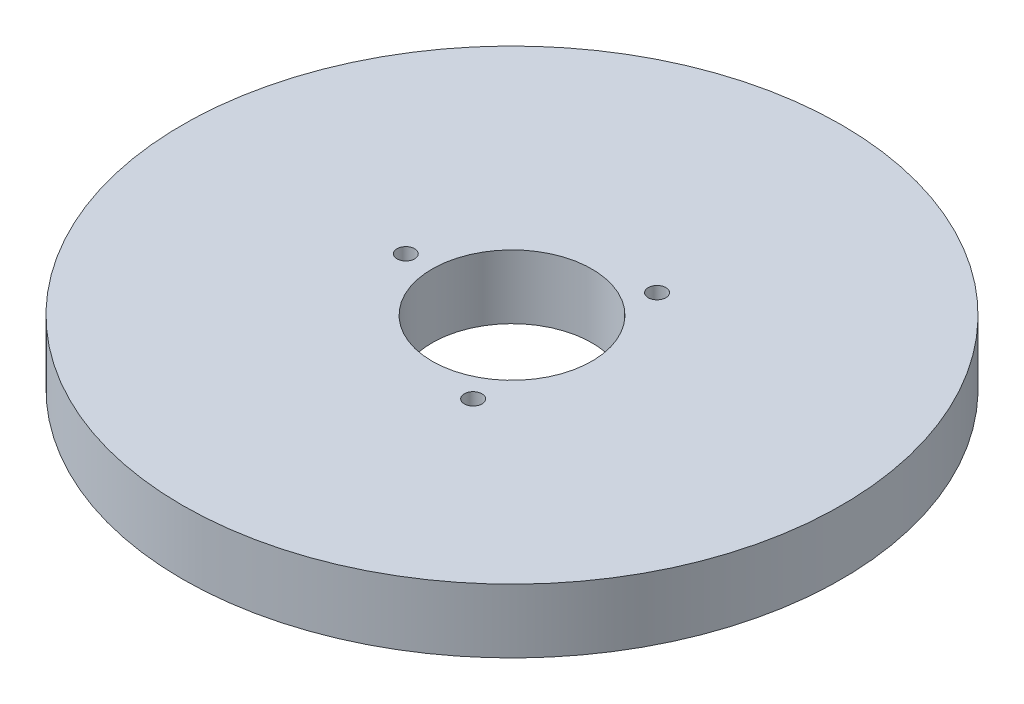
ISO-10303-21;
HEADER;
FILE_DESCRIPTION(('STEP AP214'),'2;1');
FILE_NAME('part.step','',(''),(''),'','','');
FILE_SCHEMA(('AUTOMOTIVE_DESIGN { 1 0 10303 214 1 1 1 1 }'));
ENDSEC;
DATA;
#1=APPLICATION_CONTEXT('core data for automotive mechanical design processes');
#2=APPLICATION_PROTOCOL_DEFINITION('international standard','automotive_design',2000,#1);
#3=PRODUCT_CONTEXT('',#1,'mechanical');
#4=PRODUCT('Part','Part','',(#3));
#5=PRODUCT_RELATED_PRODUCT_CATEGORY('part','',(#4));
#6=PRODUCT_DEFINITION_FORMATION('','',#4);
#7=PRODUCT_DEFINITION_CONTEXT('part definition',#1,'design');
#8=PRODUCT_DEFINITION('design','',#6,#7);
#9=PRODUCT_DEFINITION_SHAPE('','',#8);
#10=(LENGTH_UNIT() NAMED_UNIT(*) SI_UNIT(.MILLI.,.METRE.));
#11=(NAMED_UNIT(*) PLANE_ANGLE_UNIT() SI_UNIT($,.RADIAN.));
#12=(NAMED_UNIT(*) SI_UNIT($,.STERADIAN.) SOLID_ANGLE_UNIT());
#13=UNCERTAINTY_MEASURE_WITH_UNIT(LENGTH_MEASURE(1.E-05),#10,'distance_accuracy_value','');
#14=(GEOMETRIC_REPRESENTATION_CONTEXT(3) GLOBAL_UNCERTAINTY_ASSIGNED_CONTEXT((#13)) GLOBAL_UNIT_ASSIGNED_CONTEXT((#10,
#11,#12)) REPRESENTATION_CONTEXT('',''));
#15=CARTESIAN_POINT('',(0.,0.,0.));
#16=DIRECTION('',(0.,0.,1.));
#17=DIRECTION('',(1.,0.,0.));
#18=AXIS2_PLACEMENT_3D('',#15,#16,#17);
#19=CARTESIAN_POINT('',(0.,16.,0.));
#20=DIRECTION('',(0.,-1.,0.));
#21=DIRECTION('',(0.,0.,-1.));
#22=AXIS2_PLACEMENT_3D('',#19,#20,#21);
#23=CYLINDRICAL_SURFACE('',#22,82.5);
#24=CARTESIAN_POINT('',(0.,16.,0.));
#25=DIRECTION('',(0.,1.,0.));
#26=DIRECTION('',(0.,0.,1.));
#27=AXIS2_PLACEMENT_3D('',#24,#25,#26);
#28=CIRCLE('',#27,82.5);
#29=CARTESIAN_POINT('',(0.,16.,82.5));
#30=VERTEX_POINT('',#29);
#31=EDGE_CURVE('E10',#30,#30,#28,.T.);
#32=ORIENTED_EDGE('',*,*,#31,.F.);
#33=EDGE_LOOP('',(#32));
#34=FACE_BOUND('',#33,.T.);
#35=CARTESIAN_POINT('',(0.,0.,0.));
#36=DIRECTION('',(0.,1.,0.));
#37=DIRECTION('',(0.,0.,1.));
#38=AXIS2_PLACEMENT_3D('',#35,#36,#37);
#39=CIRCLE('',#38,82.5);
#40=CARTESIAN_POINT('',(0.,0.,82.5));
#41=VERTEX_POINT('',#40);
#42=EDGE_CURVE('E37',#41,#41,#39,.T.);
#43=ORIENTED_EDGE('',*,*,#42,.T.);
#44=EDGE_LOOP('',(#43));
#45=FACE_BOUND('',#44,.T.);
#46=ADVANCED_FACE('F40',(#34,#45),#23,.T.);
#47=CARTESIAN_POINT('',(0.,16.,0.));
#48=DIRECTION('',(0.,1.,0.));
#49=DIRECTION('',(0.,0.,1.));
#50=AXIS2_PLACEMENT_3D('',#47,#48,#49);
#51=PLANE('',#50);
#52=CARTESIAN_POINT('',(13.2921370757235,16.,23.0226567563229));
#53=DIRECTION('',(0.,1.,0.));
#54=DIRECTION('',(0.866025403784436,0.,-0.500000000000004));
#55=AXIS2_PLACEMENT_3D('',#52,#53,#54);
#56=CIRCLE('',#55,2.2087436824083);
#57=CARTESIAN_POINT('',(15.2049652151375,16.,21.9182849151188));
#58=VERTEX_POINT('',#57);
#59=EDGE_CURVE('E70',#58,#58,#56,.T.);
#60=ORIENTED_EDGE('',*,*,#59,.F.);
#61=EDGE_LOOP('',(#60));
#62=FACE_BOUND('',#61,.T.);
#63=CARTESIAN_POINT('',(13.2921370757232,16.,-23.0226567563231));
#64=DIRECTION('',(0.,1.,0.));
#65=DIRECTION('',(-0.866025403784443,0.,-0.499999999999992));
#66=AXIS2_PLACEMENT_3D('',#63,#64,#65);
#67=CIRCLE('',#66,2.2087436824083);
#68=CARTESIAN_POINT('',(11.3793089363092,16.,-24.1270285975272));
#69=VERTEX_POINT('',#68);
#70=EDGE_CURVE('E61',#69,#69,#67,.T.);
#71=ORIENTED_EDGE('',*,*,#70,.F.);
#72=EDGE_LOOP('',(#71));
#73=FACE_BOUND('',#72,.T.);
#74=CARTESIAN_POINT('',(-26.5842741514469,16.,0.));
#75=DIRECTION('',(0.,1.,0.));
#76=DIRECTION('',(0.,0.,1.));
#77=AXIS2_PLACEMENT_3D('',#74,#75,#76);
#78=CIRCLE('',#77,2.2087436824083);
#79=CARTESIAN_POINT('',(-26.5842741514469,16.,2.2087436824083));
#80=VERTEX_POINT('',#79);
#81=EDGE_CURVE('E54',#80,#80,#78,.T.);
#82=ORIENTED_EDGE('',*,*,#81,.F.);
#83=EDGE_LOOP('',(#82));
#84=FACE_BOUND('',#83,.T.);
#85=CARTESIAN_POINT('',(0.,16.,0.));
#86=DIRECTION('',(0.,1.,0.));
#87=DIRECTION('',(0.,0.,1.));
#88=AXIS2_PLACEMENT_3D('',#85,#86,#87);
#89=CIRCLE('',#88,20.);
#90=CARTESIAN_POINT('',(0.,16.,20.));
#91=VERTEX_POINT('',#90);
#92=EDGE_CURVE('E50',#91,#91,#89,.T.);
#93=ORIENTED_EDGE('',*,*,#92,.F.);
#94=EDGE_LOOP('',(#93));
#95=FACE_BOUND('',#94,.T.);
#96=ORIENTED_EDGE('',*,*,#31,.T.);
#97=EDGE_LOOP('',(#96));
#98=FACE_BOUND('',#97,.T.);
#99=ADVANCED_FACE('F85',(#62,#73,#84,#95,#98),#51,.T.);
#100=CARTESIAN_POINT('',(0.,0.,0.));
#101=DIRECTION('',(0.,1.,0.));
#102=DIRECTION('',(0.,0.,1.));
#103=AXIS2_PLACEMENT_3D('',#100,#101,#102);
#104=PLANE('',#103);
#105=CARTESIAN_POINT('',(0.,0.,0.));
#106=DIRECTION('',(0.,1.,0.));
#107=DIRECTION('',(0.,0.,1.));
#108=AXIS2_PLACEMENT_3D('',#105,#106,#107);
#109=CIRCLE('',#108,20.);
#110=CARTESIAN_POINT('',(0.,0.,20.));
#111=VERTEX_POINT('',#110);
#112=EDGE_CURVE('E47',#111,#111,#109,.T.);
#113=ORIENTED_EDGE('',*,*,#112,.T.);
#114=EDGE_LOOP('',(#113));
#115=FACE_BOUND('',#114,.T.);
#116=ORIENTED_EDGE('',*,*,#42,.F.);
#117=EDGE_LOOP('',(#116));
#118=FACE_BOUND('',#117,.T.);
#119=ADVANCED_FACE('F84',(#115,#118),#104,.F.);
#120=CARTESIAN_POINT('',(0.,16.,0.));
#121=DIRECTION('',(0.,-1.,0.));
#122=DIRECTION('',(0.,0.,-1.));
#123=AXIS2_PLACEMENT_3D('',#120,#121,#122);
#124=CYLINDRICAL_SURFACE('',#123,20.);
#125=ORIENTED_EDGE('',*,*,#92,.T.);
#126=EDGE_LOOP('',(#125));
#127=FACE_BOUND('',#126,.T.);
#128=ORIENTED_EDGE('',*,*,#112,.F.);
#129=EDGE_LOOP('',(#128));
#130=FACE_BOUND('',#129,.T.);
#131=ADVANCED_FACE('F91',(#127,#130),#124,.F.);
#132=CARTESIAN_POINT('',(-26.5842741514469,5.6431184243213,0.));
#133=DIRECTION('',(0.,1.,0.));
#134=DIRECTION('',(0.,0.,1.));
#135=AXIS2_PLACEMENT_3D('',#132,#133,#134);
#136=CYLINDRICAL_SURFACE('',#135,2.2087436824083);
#137=CARTESIAN_POINT('',(-26.5842741514469,5.6431184243213,0.));
#138=DIRECTION('',(0.,1.,0.));
#139=DIRECTION('',(0.,0.,1.));
#140=AXIS2_PLACEMENT_3D('',#137,#138,#139);
#141=CIRCLE('',#140,2.2087436824083);
#142=CARTESIAN_POINT('',(-26.5842741514469,5.6431184243213,2.2087436824083));
#143=VERTEX_POINT('',#142);
#144=EDGE_CURVE('E55',#143,#143,#141,.T.);
#145=ORIENTED_EDGE('',*,*,#144,.F.);
#146=EDGE_LOOP('',(#145));
#147=FACE_BOUND('',#146,.T.);
#148=ORIENTED_EDGE('',*,*,#81,.T.);
#149=EDGE_LOOP('',(#148));
#150=FACE_BOUND('',#149,.T.);
#151=ADVANCED_FACE('F96',(#147,#150),#136,.F.);
#152=CARTESIAN_POINT('',(-26.5842741514469,5.6431184243213,0.));
#153=DIRECTION('',(0.,1.,0.));
#154=DIRECTION('',(0.,0.,1.));
#155=AXIS2_PLACEMENT_3D('',#152,#153,#154);
#156=PLANE('',#155);
#157=ORIENTED_EDGE('',*,*,#144,.T.);
#158=EDGE_LOOP('',(#157));
#159=FACE_BOUND('',#158,.T.);
#160=ADVANCED_FACE('F127',(#159),#156,.T.);
#161=CARTESIAN_POINT('',(13.2921370757232,5.6431184243213,-23.0226567563231));
#162=DIRECTION('',(0.,1.,0.));
#163=DIRECTION('',(0.,0.,1.));
#164=AXIS2_PLACEMENT_3D('',#161,#162,#163);
#165=CYLINDRICAL_SURFACE('',#164,2.2087436824083);
#166=CARTESIAN_POINT('',(13.2921370757232,5.6431184243213,-23.0226567563231));
#167=DIRECTION('',(0.,1.,0.));
#168=DIRECTION('',(-0.866025403784443,0.,-0.499999999999992));
#169=AXIS2_PLACEMENT_3D('',#166,#167,#168);
#170=CIRCLE('',#169,2.2087436824083);
#171=CARTESIAN_POINT('',(11.3793089363092,5.6431184243213,-24.1270285975272));
#172=VERTEX_POINT('',#171);
#173=EDGE_CURVE('E63',#172,#172,#170,.T.);
#174=ORIENTED_EDGE('',*,*,#173,.F.);
#175=EDGE_LOOP('',(#174));
#176=FACE_BOUND('',#175,.T.);
#177=ORIENTED_EDGE('',*,*,#70,.T.);
#178=EDGE_LOOP('',(#177));
#179=FACE_BOUND('',#178,.T.);
#180=ADVANCED_FACE('F133',(#176,#179),#165,.F.);
#181=CARTESIAN_POINT('',(13.2921370757232,5.6431184243213,-23.0226567563231));
#182=DIRECTION('',(0.,1.,0.));
#183=DIRECTION('',(-0.866025403784443,0.,-0.499999999999992));
#184=AXIS2_PLACEMENT_3D('',#181,#182,#183);
#185=PLANE('',#184);
#186=ORIENTED_EDGE('',*,*,#173,.T.);
#187=EDGE_LOOP('',(#186));
#188=FACE_BOUND('',#187,.T.);
#189=ADVANCED_FACE('F77',(#188),#185,.T.);
#190=CARTESIAN_POINT('',(13.2921370757235,5.6431184243213,23.0226567563229));
#191=DIRECTION('',(0.,1.,0.));
#192=DIRECTION('',(0.,0.,1.));
#193=AXIS2_PLACEMENT_3D('',#190,#191,#192);
#194=CYLINDRICAL_SURFACE('',#193,2.2087436824083);
#195=CARTESIAN_POINT('',(13.2921370757235,5.6431184243213,23.0226567563229));
#196=DIRECTION('',(0.,1.,0.));
#197=DIRECTION('',(0.866025403784436,0.,-0.500000000000004));
#198=AXIS2_PLACEMENT_3D('',#195,#196,#197);
#199=CIRCLE('',#198,2.2087436824083);
#200=CARTESIAN_POINT('',(15.2049652151375,5.6431184243213,21.9182849151188));
#201=VERTEX_POINT('',#200);
#202=EDGE_CURVE('E59',#201,#201,#199,.T.);
#203=ORIENTED_EDGE('',*,*,#202,.F.);
#204=EDGE_LOOP('',(#203));
#205=FACE_BOUND('',#204,.T.);
#206=ORIENTED_EDGE('',*,*,#59,.T.);
#207=EDGE_LOOP('',(#206));
#208=FACE_BOUND('',#207,.T.);
#209=ADVANCED_FACE('F73',(#205,#208),#194,.F.);
#210=CARTESIAN_POINT('',(13.2921370757235,5.6431184243213,23.0226567563229));
#211=DIRECTION('',(0.,1.,0.));
#212=DIRECTION('',(0.866025403784436,0.,-0.500000000000004));
#213=AXIS2_PLACEMENT_3D('',#210,#211,#212);
#214=PLANE('',#213);
#215=ORIENTED_EDGE('',*,*,#202,.T.);
#216=EDGE_LOOP('',(#215));
#217=FACE_BOUND('',#216,.T.);
#218=ADVANCED_FACE('F71',(#217),#214,.T.);
#219=CLOSED_SHELL('',(#46,#99,#119,#131,#151,#160,#180,#189,#209,#218));
#220=MANIFOLD_SOLID_BREP('B2',#219);
#221=ADVANCED_BREP_SHAPE_REPRESENTATION('',(#18,#220),#14);
#222=SHAPE_DEFINITION_REPRESENTATION(#9,#221);
ENDSEC;
END-ISO-10303-21;
